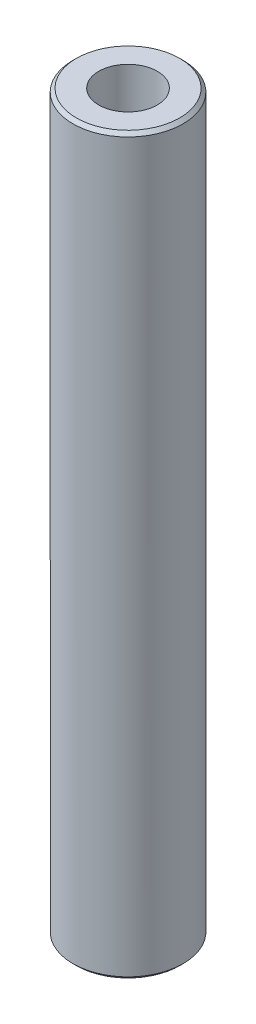
ISO-10303-21;
HEADER;
FILE_DESCRIPTION(('STEP AP214'),'2;1');
FILE_NAME('part.step','',(''),(''),'','','');
FILE_SCHEMA(('AUTOMOTIVE_DESIGN { 1 0 10303 214 1 1 1 1 }'));
ENDSEC;
DATA;
#1=APPLICATION_CONTEXT('core data for automotive mechanical design processes');
#2=APPLICATION_PROTOCOL_DEFINITION('international standard','automotive_design',2000,#1);
#3=PRODUCT_CONTEXT('',#1,'mechanical');
#4=PRODUCT('Part','Part','',(#3));
#5=PRODUCT_RELATED_PRODUCT_CATEGORY('part','',(#4));
#6=PRODUCT_DEFINITION_FORMATION('','',#4);
#7=PRODUCT_DEFINITION_CONTEXT('part definition',#1,'design');
#8=PRODUCT_DEFINITION('design','',#6,#7);
#9=PRODUCT_DEFINITION_SHAPE('','',#8);
#10=(LENGTH_UNIT() NAMED_UNIT(*) SI_UNIT(.MILLI.,.METRE.));
#11=(NAMED_UNIT(*) PLANE_ANGLE_UNIT() SI_UNIT($,.RADIAN.));
#12=(NAMED_UNIT(*) SI_UNIT($,.STERADIAN.) SOLID_ANGLE_UNIT());
#13=UNCERTAINTY_MEASURE_WITH_UNIT(LENGTH_MEASURE(1.E-05),#10,'distance_accuracy_value','');
#14=(GEOMETRIC_REPRESENTATION_CONTEXT(3) GLOBAL_UNCERTAINTY_ASSIGNED_CONTEXT((#13)) GLOBAL_UNIT_ASSIGNED_CONTEXT((#10,
#11,#12)) REPRESENTATION_CONTEXT('',''));
#15=CARTESIAN_POINT('',(0.,0.,0.));
#16=DIRECTION('',(0.,0.,1.));
#17=DIRECTION('',(1.,0.,0.));
#18=AXIS2_PLACEMENT_3D('',#15,#16,#17);
#19=CARTESIAN_POINT('',(0.,600.,0.));
#20=DIRECTION('',(0.,-1.,0.));
#21=DIRECTION('',(0.,0.,-1.));
#22=AXIS2_PLACEMENT_3D('',#19,#20,#21);
#23=CYLINDRICAL_SURFACE('',#22,45.);
#24=CARTESIAN_POINT('',(0.,597.213701049955,0.));
#25=DIRECTION('',(0.,1.,0.));
#26=DIRECTION('',(0.,0.,1.));
#27=AXIS2_PLACEMENT_3D('',#24,#25,#26);
#28=CIRCLE('',#27,45.);
#29=CARTESIAN_POINT('',(0.,597.213701049955,-45.0000000000001));
#30=VERTEX_POINT('',#29);
#31=EDGE_CURVE('E50',#30,#30,#28,.F.);
#32=ORIENTED_EDGE('',*,*,#31,.T.);
#33=EDGE_LOOP('',(#32));
#34=FACE_BOUND('',#33,.T.);
#35=CARTESIAN_POINT('',(0.,2.78629895004479,0.));
#36=DIRECTION('',(0.,1.,0.));
#37=DIRECTION('',(0.,0.,1.));
#38=AXIS2_PLACEMENT_3D('',#35,#36,#37);
#39=CIRCLE('',#38,45.);
#40=CARTESIAN_POINT('',(0.,2.78629895004479,45.));
#41=VERTEX_POINT('',#40);
#42=EDGE_CURVE('E51',#41,#41,#39,.T.);
#43=ORIENTED_EDGE('',*,*,#42,.T.);
#44=EDGE_LOOP('',(#43));
#45=FACE_BOUND('',#44,.T.);
#46=ADVANCED_FACE('F39',(#34,#45),#23,.T.);
#47=CARTESIAN_POINT('',(0.,600.,0.));
#48=DIRECTION('',(0.,1.,0.));
#49=DIRECTION('',(0.,0.,1.));
#50=AXIS2_PLACEMENT_3D('',#47,#48,#49);
#51=PLANE('',#50);
#52=CARTESIAN_POINT('',(0.,600.,0.));
#53=DIRECTION('',(0.,1.,0.));
#54=DIRECTION('',(0.,0.,1.));
#55=AXIS2_PLACEMENT_3D('',#52,#53,#54);
#56=CIRCLE('',#55,42.2137010499551);
#57=CARTESIAN_POINT('',(0.,600.,-42.2137010499552));
#58=VERTEX_POINT('',#57);
#59=EDGE_CURVE('E54',#58,#58,#56,.T.);
#60=ORIENTED_EDGE('',*,*,#59,.T.);
#61=EDGE_LOOP('',(#60));
#62=FACE_BOUND('',#61,.T.);
#63=CARTESIAN_POINT('',(0.,600.,0.));
#64=DIRECTION('',(0.,1.,0.));
#65=DIRECTION('',(0.,0.,1.));
#66=AXIS2_PLACEMENT_3D('',#63,#64,#65);
#67=CIRCLE('',#66,23.9099115269533);
#68=CARTESIAN_POINT('',(0.,600.,23.9099115269533));
#69=VERTEX_POINT('',#68);
#70=EDGE_CURVE('E58',#69,#69,#67,.T.);
#71=ORIENTED_EDGE('',*,*,#70,.F.);
#72=EDGE_LOOP('',(#71));
#73=FACE_BOUND('',#72,.T.);
#74=ADVANCED_FACE('F69',(#62,#73),#51,.T.);
#75=CARTESIAN_POINT('',(0.,0.,0.));
#76=DIRECTION('',(0.,1.,0.));
#77=DIRECTION('',(0.,0.,1.));
#78=AXIS2_PLACEMENT_3D('',#75,#76,#77);
#79=PLANE('',#78);
#80=CARTESIAN_POINT('',(0.,0.,0.));
#81=DIRECTION('',(0.,1.,0.));
#82=DIRECTION('',(0.,0.,1.));
#83=AXIS2_PLACEMENT_3D('',#80,#81,#82);
#84=CIRCLE('',#83,42.2137010499552);
#85=CARTESIAN_POINT('',(0.,0.,42.2137010499552));
#86=VERTEX_POINT('',#85);
#87=EDGE_CURVE('E10',#86,#86,#84,.F.);
#88=ORIENTED_EDGE('',*,*,#87,.T.);
#89=EDGE_LOOP('',(#88));
#90=FACE_BOUND('',#89,.T.);
#91=CARTESIAN_POINT('',(0.,0.,0.));
#92=DIRECTION('',(0.,1.,0.));
#93=DIRECTION('',(0.,0.,1.));
#94=AXIS2_PLACEMENT_3D('',#91,#92,#93);
#95=CIRCLE('',#94,23.9099115269533);
#96=CARTESIAN_POINT('',(0.,0.,23.9099115269533));
#97=VERTEX_POINT('',#96);
#98=EDGE_CURVE('E63',#97,#97,#95,.T.);
#99=ORIENTED_EDGE('',*,*,#98,.T.);
#100=EDGE_LOOP('',(#99));
#101=FACE_BOUND('',#100,.T.);
#102=ADVANCED_FACE('F75',(#90,#101),#79,.F.);
#103=CARTESIAN_POINT('',(0.,600.,0.));
#104=DIRECTION('',(0.,-1.,0.));
#105=DIRECTION('',(0.,0.,-1.));
#106=AXIS2_PLACEMENT_3D('',#103,#104,#105);
#107=CYLINDRICAL_SURFACE('',#106,23.9099115269533);
#108=ORIENTED_EDGE('',*,*,#70,.T.);
#109=EDGE_LOOP('',(#108));
#110=FACE_BOUND('',#109,.T.);
#111=ORIENTED_EDGE('',*,*,#98,.F.);
#112=EDGE_LOOP('',(#111));
#113=FACE_BOUND('',#112,.T.);
#114=ADVANCED_FACE('F70',(#110,#113),#107,.F.);
#115=CARTESIAN_POINT('',(0.,600.,0.));
#116=DIRECTION('',(0.,-1.,0.));
#117=DIRECTION('',(0.,0.,-1.));
#118=AXIS2_PLACEMENT_3D('',#115,#116,#117);
#119=CONICAL_SURFACE('',#118,42.2137010499551,0.785398163397442);
#120=CARTESIAN_POINT('',(0.,597.213701049955,-45.0000000000001));
#121=CARTESIAN_POINT('',(0.,597.242724997351,-44.9709760526037));
#122=CARTESIAN_POINT('',(0.,597.271748944748,-44.9419521052074));
#123=CARTESIAN_POINT('',(0.,597.32979683954,-44.8839042104149));
#124=CARTESIAN_POINT('',(0.,597.358820786936,-44.8548802630186));
#125=CARTESIAN_POINT('',(0.,597.416868681729,-44.796832368226));
#126=CARTESIAN_POINT('',(0.,597.445892629125,-44.7678084208297));
#127=CARTESIAN_POINT('',(0.,597.503940523918,-44.7097605260371));
#128=CARTESIAN_POINT('',(0.,597.532964471314,-44.6807365786408));
#129=CARTESIAN_POINT('',(0.,597.591012366107,-44.6226886838482));
#130=CARTESIAN_POINT('',(0.,597.620036313503,-44.5936647364519));
#131=CARTESIAN_POINT('',(0.,597.678084208296,-44.5356168416593));
#132=CARTESIAN_POINT('',(0.,597.707108155692,-44.5065928942629));
#133=CARTESIAN_POINT('',(0.,597.765156050485,-44.4485449994703));
#134=CARTESIAN_POINT('',(0.,597.794179997881,-44.419521052074));
#135=CARTESIAN_POINT('',(0.,597.852227892674,-44.3614731572815));
#136=CARTESIAN_POINT('',(0.,597.88125184007,-44.3324492098851));
#137=CARTESIAN_POINT('',(0.,597.939299734863,-44.2744013150925));
#138=CARTESIAN_POINT('',(0.,597.968323682259,-44.2453773676962));
#139=CARTESIAN_POINT('',(0.,598.026371577051,-44.1873294729036));
#140=CARTESIAN_POINT('',(0.,598.055395524448,-44.1583055255074));
#141=CARTESIAN_POINT('',(0.,598.11344341924,-44.1002576307148));
#142=CARTESIAN_POINT('',(0.,598.142467366637,-44.0712336833184));
#143=CARTESIAN_POINT('',(0.,598.200515261429,-44.0131857885258));
#144=CARTESIAN_POINT('',(0.,598.229539208825,-43.9841618411295));
#145=CARTESIAN_POINT('',(0.,598.287587103618,-43.9261139463369));
#146=CARTESIAN_POINT('',(0.,598.316611051014,-43.8970899989406));
#147=CARTESIAN_POINT('',(0.,598.374658945807,-43.839042104148));
#148=CARTESIAN_POINT('',(0.,598.403682893203,-43.8100181567517));
#149=CARTESIAN_POINT('',(0.,598.461730787996,-43.7519702619591));
#150=CARTESIAN_POINT('',(0.,598.490754735392,-43.7229463145628));
#151=CARTESIAN_POINT('',(0.,598.548802630185,-43.6648984197702));
#152=CARTESIAN_POINT('',(0.,598.577826577581,-43.6358744723739));
#153=CARTESIAN_POINT('',(0.,598.635874472374,-43.5778265775813));
#154=CARTESIAN_POINT('',(0.,598.66489841977,-43.548802630185));
#155=CARTESIAN_POINT('',(0.,598.722946314563,-43.4907547353924));
#156=CARTESIAN_POINT('',(0.,598.751970261959,-43.4617307879961));
#157=CARTESIAN_POINT('',(0.,598.810018156752,-43.4036828932035));
#158=CARTESIAN_POINT('',(0.,598.839042104148,-43.3746589458072));
#159=CARTESIAN_POINT('',(0.,598.89708999894,-43.3166110510146));
#160=CARTESIAN_POINT('',(0.,598.926113946337,-43.2875871036183));
#161=CARTESIAN_POINT('',(0.,598.984161841129,-43.2295392088257));
#162=CARTESIAN_POINT('',(0.,599.013185788526,-43.2005152614294));
#163=CARTESIAN_POINT('',(0.,599.071233683318,-43.1424673666368));
#164=CARTESIAN_POINT('',(0.,599.100257630715,-43.1134434192405));
#165=CARTESIAN_POINT('',(0.,599.158305525507,-43.0553955244479));
#166=CARTESIAN_POINT('',(0.,599.187329472903,-43.0263715770516));
#167=CARTESIAN_POINT('',(0.,599.245377367696,-42.968323682259));
#168=CARTESIAN_POINT('',(0.,599.274401315092,-42.9392997348627));
#169=CARTESIAN_POINT('',(0.,599.332449209885,-42.8812518400701));
#170=CARTESIAN_POINT('',(0.,599.361473157281,-42.8522278926738));
#171=CARTESIAN_POINT('',(0.,599.419521052074,-42.7941799978812));
#172=CARTESIAN_POINT('',(0.,599.44854499947,-42.7651560504849));
#173=CARTESIAN_POINT('',(0.,599.506592894263,-42.7071081556923));
#174=CARTESIAN_POINT('',(0.,599.535616841659,-42.678084208296));
#175=CARTESIAN_POINT('',(0.,599.593664736452,-42.6200363135034));
#176=CARTESIAN_POINT('',(0.,599.622688683848,-42.5910123661071));
#177=CARTESIAN_POINT('',(0.,599.680736578641,-42.5329644713145));
#178=CARTESIAN_POINT('',(0.,599.709760526037,-42.5039405239182));
#179=CARTESIAN_POINT('',(0.,599.76780842083,-42.4458926291256));
#180=CARTESIAN_POINT('',(0.,599.796832368226,-42.4168686817293));
#181=CARTESIAN_POINT('',(0.,599.854880263018,-42.3588207869367));
#182=CARTESIAN_POINT('',(0.,599.883904210415,-42.3297968395404));
#183=CARTESIAN_POINT('',(0.,599.941952105207,-42.2717489447478));
#184=CARTESIAN_POINT('',(0.,599.970976052604,-42.2427249973515));
#185=CARTESIAN_POINT('',(0.,600.,-42.2137010499552));
#186=B_SPLINE_CURVE_WITH_KNOTS('',3,(#120,#121,#122,#123,#124,#125,#126,#127,#128,#129,#130,
#131,#132,#133,#134,#135,#136,#137,#138,#139,#140,#141,#142,#143,#144,#145,#146,#147,#148,#149,
#150,#151,#152,#153,#154,#155,#156,#157,#158,#159,#160,#161,#162,#163,#164,#165,#166,#167,#168,
#169,#170,#171,#172,#173,#174,#175,#176,#177,#178,#179,#180,#181,#182,#183,#184,#185),
.UNSPECIFIED.,.F.,.F.,(4,2,2,2,2,2,2,2,2,2,2,2,2,2,2,2,2,2,2,2,2,2,2,2,2,2,2,2,2,2,2,2,4),(0.,
0.123138180124293,0.246276360248664,0.369414540373035,0.492552720497402,0.615690900621773,
0.738829080746065,0.861967260870437,0.985105440994808,1.10824362111918,1.23138180124355,
1.35451998136784,1.47765816149221,1.60079634161658,1.72393452174095,1.84707270186532,
1.97021088198969,2.09334906211398,2.21648724223835,2.33962542236272,2.4627636024871,
2.58590178261147,2.70903996273576,2.83217814286013,2.9553163229845,3.07845450310887,
3.20159268323324,3.32473086335753,3.4478690434819,3.57100722360627,3.69414540373064,
3.81728358385501,3.94042176397938),.UNSPECIFIED.);
#187=EDGE_CURVE('BSEAM81',#30,#58,#186,.T.);
#188=ORIENTED_EDGE('',*,*,#31,.F.);
#189=ORIENTED_EDGE('',*,*,#59,.F.);
#190=ORIENTED_EDGE('',*,*,#187,.T.);
#191=ORIENTED_EDGE('',*,*,#187,.F.);
#192=EDGE_LOOP('',(#188,#190,#189,#191));
#193=FACE_BOUND('',#192,.T.);
#194=ADVANCED_FACE('F81',(#193),#119,.T.);
#195=CARTESIAN_POINT('',(0.,2.78629895004479,0.));
#196=DIRECTION('',(0.,1.,0.));
#197=DIRECTION('',(0.,0.,1.));
#198=AXIS2_PLACEMENT_3D('',#195,#196,#197);
#199=CONICAL_SURFACE('',#198,45.,0.785398163397453);
#200=ORIENTED_EDGE('',*,*,#87,.F.);
#201=EDGE_LOOP('',(#200));
#202=FACE_BOUND('',#201,.T.);
#203=ORIENTED_EDGE('',*,*,#42,.F.);
#204=EDGE_LOOP('',(#203));
#205=FACE_BOUND('',#204,.T.);
#206=ADVANCED_FACE('F45',(#202,#205),#199,.T.);
#207=CLOSED_SHELL('',(#46,#74,#102,#114,#194,#206));
#208=MANIFOLD_SOLID_BREP('B2',#207);
#209=ADVANCED_BREP_SHAPE_REPRESENTATION('',(#18,#208),#14);
#210=SHAPE_DEFINITION_REPRESENTATION(#9,#209);
ENDSEC;
END-ISO-10303-21;
